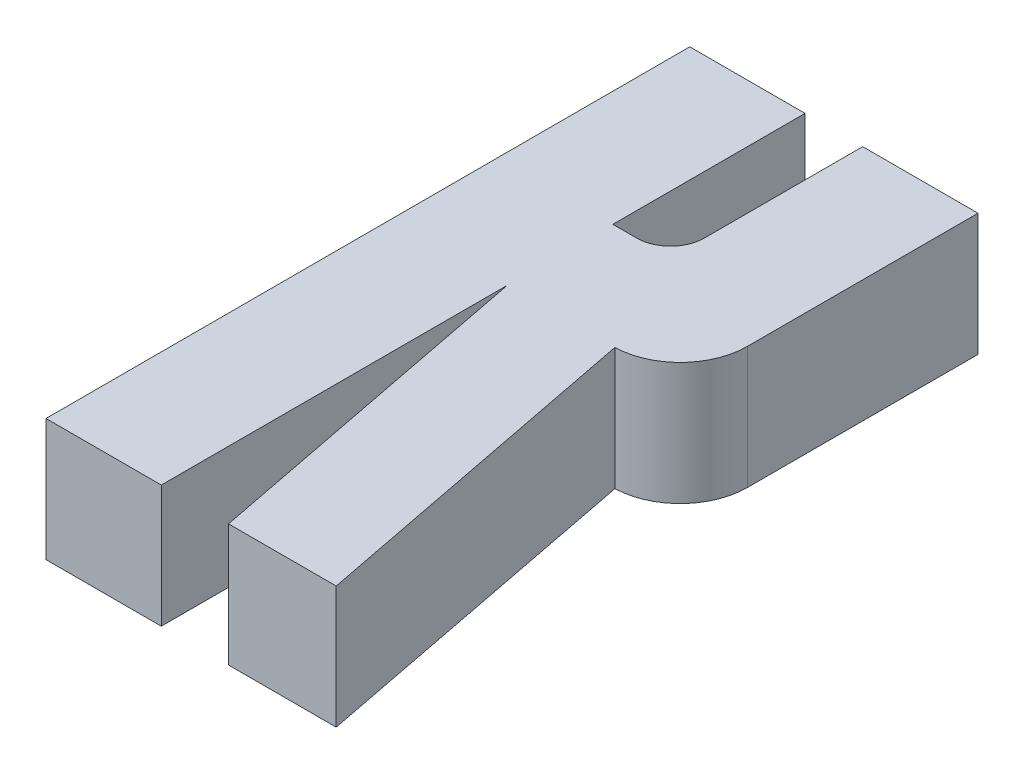
ISO-10303-21;
HEADER;
FILE_DESCRIPTION(('STEP AP214'),'2;1');
FILE_NAME('part.step','',(''),(''),'','','');
FILE_SCHEMA(('AUTOMOTIVE_DESIGN { 1 0 10303 214 1 1 1 1 }'));
ENDSEC;
DATA;
#1=APPLICATION_CONTEXT('core data for automotive mechanical design processes');
#2=APPLICATION_PROTOCOL_DEFINITION('international standard','automotive_design',2000,#1);
#3=PRODUCT_CONTEXT('',#1,'mechanical');
#4=PRODUCT('Part','Part','',(#3));
#5=PRODUCT_RELATED_PRODUCT_CATEGORY('part','',(#4));
#6=PRODUCT_DEFINITION_FORMATION('','',#4);
#7=PRODUCT_DEFINITION_CONTEXT('part definition',#1,'design');
#8=PRODUCT_DEFINITION('design','',#6,#7);
#9=PRODUCT_DEFINITION_SHAPE('','',#8);
#10=(LENGTH_UNIT() NAMED_UNIT(*) SI_UNIT(.MILLI.,.METRE.));
#11=(NAMED_UNIT(*) PLANE_ANGLE_UNIT() SI_UNIT($,.RADIAN.));
#12=(NAMED_UNIT(*) SI_UNIT($,.STERADIAN.) SOLID_ANGLE_UNIT());
#13=UNCERTAINTY_MEASURE_WITH_UNIT(LENGTH_MEASURE(1.E-05),#10,'distance_accuracy_value','');
#14=(GEOMETRIC_REPRESENTATION_CONTEXT(3) GLOBAL_UNCERTAINTY_ASSIGNED_CONTEXT((#13)) GLOBAL_UNIT_ASSIGNED_CONTEXT((#10,
#11,#12)) REPRESENTATION_CONTEXT('',''));
#15=CARTESIAN_POINT('',(0.,0.,0.));
#16=DIRECTION('',(0.,0.,1.));
#17=DIRECTION('',(1.,0.,0.));
#18=AXIS2_PLACEMENT_3D('',#15,#16,#17);
#19=CARTESIAN_POINT('',(857.737617422486,-71.,1297.8980276768));
#20=DIRECTION('',(1.,0.,0.));
#21=DIRECTION('',(0.,0.,-1.));
#22=AXIS2_PLACEMENT_3D('',#19,#20,#21);
#23=PLANE('',#22);
#24=DIRECTION('',(0.,0.,1.));
#25=VECTOR('',#24,1.);
#26=CARTESIAN_POINT('',(857.737617422486,-79.,1297.8980276768));
#27=LINE('',#26,#25);
#28=CARTESIAN_POINT('',(857.737617422486,-79.,1297.8980276768));
#29=VERTEX_POINT('',#28);
#30=CARTESIAN_POINT('',(857.737617422486,-79.,1340.0191783547));
#31=VERTEX_POINT('',#30);
#32=EDGE_CURVE('E123',#29,#31,#27,.T.);
#33=ORIENTED_EDGE('',*,*,#32,.T.);
#34=DIRECTION('',(0.,-1.,0.));
#35=VECTOR('',#34,1.);
#36=CARTESIAN_POINT('',(857.737617422486,-71.,1340.0191783547));
#37=LINE('',#36,#35);
#38=CARTESIAN_POINT('',(857.737617422486,-71.,1340.0191783547));
#39=VERTEX_POINT('',#38);
#40=EDGE_CURVE('E11',#39,#31,#37,.T.);
#41=ORIENTED_EDGE('',*,*,#40,.F.);
#42=DIRECTION('',(0.,0.,1.));
#43=VECTOR('',#42,1.);
#44=CARTESIAN_POINT('',(857.737617422486,-71.,1297.8980276768));
#45=LINE('',#44,#43);
#46=CARTESIAN_POINT('',(857.737617422486,-71.,1297.8980276768));
#47=VERTEX_POINT('',#46);
#48=EDGE_CURVE('E142',#47,#39,#45,.T.);
#49=ORIENTED_EDGE('',*,*,#48,.F.);
#50=DIRECTION('',(0.,-1.,0.));
#51=VECTOR('',#50,1.);
#52=CARTESIAN_POINT('',(857.737617422486,-71.,1297.8980276768));
#53=LINE('',#52,#51);
#54=EDGE_CURVE('E30',#47,#29,#53,.T.);
#55=ORIENTED_EDGE('',*,*,#54,.T.);
#56=EDGE_LOOP('',(#33,#41,#49,#55));
#57=FACE_BOUND('',#56,.T.);
#58=ADVANCED_FACE('F16',(#57),#23,.F.);
#59=CARTESIAN_POINT('',(857.737617422486,-71.,1340.0191783547));
#60=DIRECTION('',(0.,0.,-1.));
#61=DIRECTION('',(-1.,0.,0.));
#62=AXIS2_PLACEMENT_3D('',#59,#60,#61);
#63=PLANE('',#62);
#64=DIRECTION('',(1.,0.,0.));
#65=VECTOR('',#64,1.);
#66=CARTESIAN_POINT('',(857.737617422486,-79.,1340.0191783547));
#67=LINE('',#66,#65);
#68=CARTESIAN_POINT('',(865.281704111066,-79.,1340.0191783547));
#69=VERTEX_POINT('',#68);
#70=EDGE_CURVE('E119',#31,#69,#67,.T.);
#71=ORIENTED_EDGE('',*,*,#70,.T.);
#72=DIRECTION('',(0.,-1.,0.));
#73=VECTOR('',#72,1.);
#74=CARTESIAN_POINT('',(865.281704111066,-71.,1340.0191783547));
#75=LINE('',#74,#73);
#76=CARTESIAN_POINT('',(865.281704111066,-71.,1340.0191783547));
#77=VERTEX_POINT('',#76);
#78=EDGE_CURVE('E23',#77,#69,#75,.T.);
#79=ORIENTED_EDGE('',*,*,#78,.F.);
#80=DIRECTION('',(1.,0.,0.));
#81=VECTOR('',#80,1.);
#82=CARTESIAN_POINT('',(857.737617422486,-71.,1340.0191783547));
#83=LINE('',#82,#81);
#84=EDGE_CURVE('E132',#39,#77,#83,.T.);
#85=ORIENTED_EDGE('',*,*,#84,.F.);
#86=ORIENTED_EDGE('',*,*,#40,.T.);
#87=EDGE_LOOP('',(#71,#79,#85,#86));
#88=FACE_BOUND('',#87,.T.);
#89=ADVANCED_FACE('F131',(#88),#63,.F.);
#90=CARTESIAN_POINT('',(865.281704111066,-71.,1340.0191783547));
#91=DIRECTION('',(-1.,0.,0.));
#92=DIRECTION('',(0.,0.,1.));
#93=AXIS2_PLACEMENT_3D('',#90,#91,#92);
#94=PLANE('',#93);
#95=DIRECTION('',(0.,0.,-1.));
#96=VECTOR('',#95,1.);
#97=CARTESIAN_POINT('',(865.281704111066,-79.,1340.0191783547));
#98=LINE('',#97,#96);
#99=CARTESIAN_POINT('',(865.281704111066,-79.,1317.38691828896));
#100=VERTEX_POINT('',#99);
#101=EDGE_CURVE('E125',#69,#100,#98,.T.);
#102=ORIENTED_EDGE('',*,*,#101,.T.);
#103=DIRECTION('',(0.,-1.,0.));
#104=VECTOR('',#103,1.);
#105=CARTESIAN_POINT('',(865.281704111066,-71.,1317.38691828896));
#106=LINE('',#105,#104);
#107=CARTESIAN_POINT('',(865.281704111066,-71.,1317.38691828896));
#108=VERTEX_POINT('',#107);
#109=EDGE_CURVE('E193',#108,#100,#106,.T.);
#110=ORIENTED_EDGE('',*,*,#109,.F.);
#111=DIRECTION('',(0.,0.,-1.));
#112=VECTOR('',#111,1.);
#113=CARTESIAN_POINT('',(865.281704111066,-71.,1340.0191783547));
#114=LINE('',#113,#112);
#115=EDGE_CURVE('E141',#77,#108,#114,.T.);
#116=ORIENTED_EDGE('',*,*,#115,.F.);
#117=ORIENTED_EDGE('',*,*,#78,.T.);
#118=EDGE_LOOP('',(#102,#110,#116,#117));
#119=FACE_BOUND('',#118,.T.);
#120=ADVANCED_FACE('F197',(#119),#94,.F.);
#121=CARTESIAN_POINT('',(865.281704111066,-71.,1317.38691828896));
#122=DIRECTION('',(0.981627183447664,0.,-0.190808995376545));
#123=DIRECTION('',(-0.190808995376545,0.,-0.981627183447664));
#124=AXIS2_PLACEMENT_3D('',#121,#122,#123);
#125=PLANE('',#124);
#126=DIRECTION('',(0.190808995376545,0.,0.981627183447664));
#127=VECTOR('',#126,1.);
#128=CARTESIAN_POINT('',(865.281704111066,-79.,1317.38691828896));
#129=LINE('',#128,#127);
#130=CARTESIAN_POINT('',(869.680969819129,-79.,1340.0191783547));
#131=VERTEX_POINT('',#130);
#132=EDGE_CURVE('E234',#100,#131,#129,.T.);
#133=ORIENTED_EDGE('',*,*,#132,.T.);
#134=DIRECTION('',(0.,-1.,0.));
#135=VECTOR('',#134,1.);
#136=CARTESIAN_POINT('',(869.680969819129,-71.,1340.0191783547));
#137=LINE('',#136,#135);
#138=CARTESIAN_POINT('',(869.680969819129,-71.,1340.0191783547));
#139=VERTEX_POINT('',#138);
#140=EDGE_CURVE('E190',#139,#131,#137,.T.);
#141=ORIENTED_EDGE('',*,*,#140,.F.);
#142=DIRECTION('',(0.190808995376545,0.,0.981627183447664));
#143=VECTOR('',#142,1.);
#144=CARTESIAN_POINT('',(865.281704111066,-71.,1317.38691828896));
#145=LINE('',#144,#143);
#146=EDGE_CURVE('E144',#108,#139,#145,.T.);
#147=ORIENTED_EDGE('',*,*,#146,.F.);
#148=ORIENTED_EDGE('',*,*,#109,.T.);
#149=EDGE_LOOP('',(#133,#141,#147,#148));
#150=FACE_BOUND('',#149,.T.);
#151=ADVANCED_FACE('F237',(#150),#125,.F.);
#152=CARTESIAN_POINT('',(869.680969819129,-71.,1340.0191783547));
#153=DIRECTION('',(0.,0.,-1.));
#154=DIRECTION('',(-1.,0.,0.));
#155=AXIS2_PLACEMENT_3D('',#152,#153,#154);
#156=PLANE('',#155);
#157=DIRECTION('',(1.,0.,0.));
#158=VECTOR('',#157,1.);
#159=CARTESIAN_POINT('',(869.680969819129,-79.,1340.0191783547));
#160=LINE('',#159,#158);
#161=CARTESIAN_POINT('',(876.725816288821,-79.,1340.0191783547));
#162=VERTEX_POINT('',#161);
#163=EDGE_CURVE('E231',#131,#162,#160,.T.);
#164=ORIENTED_EDGE('',*,*,#163,.T.);
#165=DIRECTION('',(0.,-1.,0.));
#166=VECTOR('',#165,1.);
#167=CARTESIAN_POINT('',(876.725816288821,-71.,1340.0191783547));
#168=LINE('',#167,#166);
#169=CARTESIAN_POINT('',(876.725816288821,-71.,1340.0191783547));
#170=VERTEX_POINT('',#169);
#171=EDGE_CURVE('E188',#170,#162,#168,.T.);
#172=ORIENTED_EDGE('',*,*,#171,.F.);
#173=DIRECTION('',(1.,0.,0.));
#174=VECTOR('',#173,1.);
#175=CARTESIAN_POINT('',(869.680969819129,-71.,1340.0191783547));
#176=LINE('',#175,#174);
#177=EDGE_CURVE('E146',#139,#170,#176,.T.);
#178=ORIENTED_EDGE('',*,*,#177,.F.);
#179=ORIENTED_EDGE('',*,*,#140,.T.);
#180=EDGE_LOOP('',(#164,#172,#178,#179));
#181=FACE_BOUND('',#180,.T.);
#182=ADVANCED_FACE('F241',(#181),#156,.F.);
#183=CARTESIAN_POINT('',(872.326182609485,-71.,1317.38502524088));
#184=DIRECTION('',(0.981627183447664,0.,-0.190808995376545));
#185=DIRECTION('',(-0.190808995376545,0.,-0.981627183447664));
#186=AXIS2_PLACEMENT_3D('',#183,#184,#185);
#187=PLANE('',#186);
#188=DIRECTION('',(0.190808995376545,0.,0.981627183447664));
#189=VECTOR('',#188,1.);
#190=CARTESIAN_POINT('',(872.326182609485,-79.,1317.38502524088));
#191=LINE('',#190,#189);
#192=CARTESIAN_POINT('',(872.326182609485,-79.,1317.38502524088));
#193=VERTEX_POINT('',#192);
#194=EDGE_CURVE('E228',#193,#162,#191,.T.);
#195=ORIENTED_EDGE('',*,*,#194,.F.);
#196=DIRECTION('',(0.,-1.,0.));
#197=VECTOR('',#196,1.);
#198=CARTESIAN_POINT('',(872.326182609485,-71.,1317.38502524088));
#199=LINE('',#198,#197);
#200=CARTESIAN_POINT('',(872.326182609485,-71.,1317.38502524088));
#201=VERTEX_POINT('',#200);
#202=EDGE_CURVE('E186',#201,#193,#199,.T.);
#203=ORIENTED_EDGE('',*,*,#202,.F.);
#204=DIRECTION('',(0.190808995376545,0.,0.981627183447664));
#205=VECTOR('',#204,1.);
#206=CARTESIAN_POINT('',(872.326182609485,-71.,1317.38502524088));
#207=LINE('',#206,#205);
#208=EDGE_CURVE('E148',#201,#170,#207,.T.);
#209=ORIENTED_EDGE('',*,*,#208,.T.);
#210=ORIENTED_EDGE('',*,*,#171,.T.);
#211=EDGE_LOOP('',(#195,#203,#209,#210));
#212=FACE_BOUND('',#211,.T.);
#213=ADVANCED_FACE('F247',(#212),#187,.T.);
#214=CARTESIAN_POINT('',(872.19711690893,-71.,1312.98620105396));
#215=DIRECTION('',(0.,-1.,0.));
#216=DIRECTION('',(0.,0.,-1.));
#217=AXIS2_PLACEMENT_3D('',#214,#215,#216);
#218=CYLINDRICAL_SURFACE('',#217,4.40071723500474);
#219=CARTESIAN_POINT('',(872.19711690893,-79.,1312.98620105396));
#220=DIRECTION('',(0.,-1.,0.));
#221=DIRECTION('',(1.,0.,0.));
#222=AXIS2_PLACEMENT_3D('',#219,#220,#221);
#223=CIRCLE('',#222,4.40071723500474);
#224=CARTESIAN_POINT('',(876.597834143935,-79.,1312.98620105396));
#225=VERTEX_POINT('',#224);
#226=EDGE_CURVE('E225',#225,#193,#223,.T.);
#227=ORIENTED_EDGE('',*,*,#226,.F.);
#228=DIRECTION('',(0.,-1.,0.));
#229=VECTOR('',#228,1.);
#230=CARTESIAN_POINT('',(876.597834143935,-71.,1312.98620105396));
#231=LINE('',#230,#229);
#232=CARTESIAN_POINT('',(876.597834143935,-71.,1312.98620105396));
#233=VERTEX_POINT('',#232);
#234=EDGE_CURVE('E184',#233,#225,#231,.T.);
#235=ORIENTED_EDGE('',*,*,#234,.F.);
#236=CARTESIAN_POINT('',(872.19711690893,-71.,1312.98620105396));
#237=DIRECTION('',(0.,-1.,0.));
#238=DIRECTION('',(1.,0.,0.));
#239=AXIS2_PLACEMENT_3D('',#236,#237,#238);
#240=CIRCLE('',#239,4.40071723500474);
#241=EDGE_CURVE('E151',#233,#201,#240,.T.);
#242=ORIENTED_EDGE('',*,*,#241,.T.);
#243=ORIENTED_EDGE('',*,*,#202,.T.);
#244=EDGE_LOOP('',(#227,#235,#242,#243));
#245=FACE_BOUND('',#244,.T.);
#246=ADVANCED_FACE('F251',(#245),#218,.T.);
#247=CARTESIAN_POINT('',(876.597834143935,-71.,1312.98620105396));
#248=DIRECTION('',(-1.,0.,0.));
#249=DIRECTION('',(0.,0.,1.));
#250=AXIS2_PLACEMENT_3D('',#247,#248,#249);
#251=PLANE('',#250);
#252=DIRECTION('',(0.,0.,-1.));
#253=VECTOR('',#252,1.);
#254=CARTESIAN_POINT('',(876.597834143935,-79.,1312.98620105396));
#255=LINE('',#254,#253);
#256=CARTESIAN_POINT('',(876.597834143935,-79.,1297.8980276768));
#257=VERTEX_POINT('',#256);
#258=EDGE_CURVE('E222',#225,#257,#255,.T.);
#259=ORIENTED_EDGE('',*,*,#258,.T.);
#260=DIRECTION('',(0.,-1.,0.));
#261=VECTOR('',#260,1.);
#262=CARTESIAN_POINT('',(876.597834143935,-71.,1297.8980276768));
#263=LINE('',#262,#261);
#264=CARTESIAN_POINT('',(876.597834143935,-71.,1297.8980276768));
#265=VERTEX_POINT('',#264);
#266=EDGE_CURVE('E182',#265,#257,#263,.T.);
#267=ORIENTED_EDGE('',*,*,#266,.F.);
#268=DIRECTION('',(0.,0.,-1.));
#269=VECTOR('',#268,1.);
#270=CARTESIAN_POINT('',(876.597834143935,-71.,1312.98620105396));
#271=LINE('',#270,#269);
#272=EDGE_CURVE('E154',#233,#265,#271,.T.);
#273=ORIENTED_EDGE('',*,*,#272,.F.);
#274=ORIENTED_EDGE('',*,*,#234,.T.);
#275=EDGE_LOOP('',(#259,#267,#273,#274));
#276=FACE_BOUND('',#275,.T.);
#277=ADVANCED_FACE('F255',(#276),#251,.F.);
#278=CARTESIAN_POINT('',(869.053747455356,-71.,1297.8980276768));
#279=DIRECTION('',(0.,0.,-1.));
#280=DIRECTION('',(-1.,0.,0.));
#281=AXIS2_PLACEMENT_3D('',#278,#279,#280);
#282=PLANE('',#281);
#283=DIRECTION('',(1.,0.,0.));
#284=VECTOR('',#283,1.);
#285=CARTESIAN_POINT('',(869.053747455356,-79.,1297.8980276768));
#286=LINE('',#285,#284);
#287=CARTESIAN_POINT('',(869.053747455356,-79.,1297.8980276768));
#288=VERTEX_POINT('',#287);
#289=EDGE_CURVE('E219',#288,#257,#286,.T.);
#290=ORIENTED_EDGE('',*,*,#289,.F.);
#291=DIRECTION('',(0.,-1.,0.));
#292=VECTOR('',#291,1.);
#293=CARTESIAN_POINT('',(869.053747455356,-71.,1297.8980276768));
#294=LINE('',#293,#292);
#295=CARTESIAN_POINT('',(869.053747455356,-71.,1297.8980276768));
#296=VERTEX_POINT('',#295);
#297=EDGE_CURVE('E180',#296,#288,#294,.T.);
#298=ORIENTED_EDGE('',*,*,#297,.F.);
#299=DIRECTION('',(1.,0.,0.));
#300=VECTOR('',#299,1.);
#301=CARTESIAN_POINT('',(869.053747455356,-71.,1297.8980276768));
#302=LINE('',#301,#300);
#303=EDGE_CURVE('E156',#296,#265,#302,.T.);
#304=ORIENTED_EDGE('',*,*,#303,.T.);
#305=ORIENTED_EDGE('',*,*,#266,.T.);
#306=EDGE_LOOP('',(#290,#298,#304,#305));
#307=FACE_BOUND('',#306,.T.);
#308=ADVANCED_FACE('F270',(#307),#282,.T.);
#309=CARTESIAN_POINT('',(869.053747455356,-71.,1308.2711468736));
#310=DIRECTION('',(-1.,0.,0.));
#311=DIRECTION('',(0.,0.,1.));
#312=AXIS2_PLACEMENT_3D('',#309,#310,#311);
#313=PLANE('',#312);
#314=DIRECTION('',(0.,0.,-1.));
#315=VECTOR('',#314,1.);
#316=CARTESIAN_POINT('',(869.053747455356,-79.,1308.2711468736));
#317=LINE('',#316,#315);
#318=CARTESIAN_POINT('',(869.053747455356,-79.,1308.2711468736));
#319=VERTEX_POINT('',#318);
#320=EDGE_CURVE('E216',#319,#288,#317,.T.);
#321=ORIENTED_EDGE('',*,*,#320,.F.);
#322=DIRECTION('',(0.,-1.,0.));
#323=VECTOR('',#322,1.);
#324=CARTESIAN_POINT('',(869.053747455356,-71.,1308.2711468736));
#325=LINE('',#324,#323);
#326=CARTESIAN_POINT('',(869.053747455356,-71.,1308.2711468736));
#327=VERTEX_POINT('',#326);
#328=EDGE_CURVE('E178',#327,#319,#325,.T.);
#329=ORIENTED_EDGE('',*,*,#328,.F.);
#330=DIRECTION('',(0.,0.,-1.));
#331=VECTOR('',#330,1.);
#332=CARTESIAN_POINT('',(869.053747455356,-71.,1308.2711468736));
#333=LINE('',#332,#331);
#334=EDGE_CURVE('E159',#327,#296,#333,.T.);
#335=ORIENTED_EDGE('',*,*,#334,.T.);
#336=ORIENTED_EDGE('',*,*,#297,.T.);
#337=EDGE_LOOP('',(#321,#329,#335,#336));
#338=FACE_BOUND('',#337,.T.);
#339=ADVANCED_FACE('F261',(#338),#313,.T.);
#340=CARTESIAN_POINT('',(866.853388837853,-71.,1308.2711468736));
#341=DIRECTION('',(0.,-1.,0.));
#342=DIRECTION('',(0.,0.,-1.));
#343=AXIS2_PLACEMENT_3D('',#340,#341,#342);
#344=CYLINDRICAL_SURFACE('',#343,2.20035861750237);
#345=CARTESIAN_POINT('',(866.853388837853,-79.,1308.2711468736));
#346=DIRECTION('',(0.,-1.,0.));
#347=DIRECTION('',(1.,0.,0.));
#348=AXIS2_PLACEMENT_3D('',#345,#346,#347);
#349=CIRCLE('',#348,2.20035861750237);
#350=CARTESIAN_POINT('',(866.853388837853,-79.,1310.4715054911));
#351=VERTEX_POINT('',#350);
#352=EDGE_CURVE('E211',#319,#351,#349,.T.);
#353=ORIENTED_EDGE('',*,*,#352,.T.);
#354=DIRECTION('',(0.,-1.,0.));
#355=VECTOR('',#354,1.);
#356=CARTESIAN_POINT('',(866.853388837853,-71.,1310.4715054911));
#357=LINE('',#356,#355);
#358=CARTESIAN_POINT('',(866.853388837853,-71.,1310.4715054911));
#359=VERTEX_POINT('',#358);
#360=EDGE_CURVE('E176',#359,#351,#357,.T.);
#361=ORIENTED_EDGE('',*,*,#360,.F.);
#362=CARTESIAN_POINT('',(866.853388837853,-71.,1308.2711468736));
#363=DIRECTION('',(0.,-1.,0.));
#364=DIRECTION('',(1.,0.,0.));
#365=AXIS2_PLACEMENT_3D('',#362,#363,#364);
#366=CIRCLE('',#365,2.20035861750237);
#367=EDGE_CURVE('E162',#327,#359,#366,.T.);
#368=ORIENTED_EDGE('',*,*,#367,.F.);
#369=ORIENTED_EDGE('',*,*,#328,.T.);
#370=EDGE_LOOP('',(#353,#361,#368,#369));
#371=FACE_BOUND('',#370,.T.);
#372=ADVANCED_FACE('F267',(#371),#344,.F.);
#373=CARTESIAN_POINT('',(865.281704111066,-71.,1310.4715054911));
#374=DIRECTION('',(0.,0.,-1.));
#375=DIRECTION('',(-1.,0.,0.));
#376=AXIS2_PLACEMENT_3D('',#373,#374,#375);
#377=PLANE('',#376);
#378=DIRECTION('',(1.,0.,0.));
#379=VECTOR('',#378,1.);
#380=CARTESIAN_POINT('',(865.281704111066,-79.,1310.4715054911));
#381=LINE('',#380,#379);
#382=CARTESIAN_POINT('',(865.281704111066,-79.,1310.4715054911));
#383=VERTEX_POINT('',#382);
#384=EDGE_CURVE('E210',#383,#351,#381,.T.);
#385=ORIENTED_EDGE('',*,*,#384,.F.);
#386=DIRECTION('',(0.,-1.,0.));
#387=VECTOR('',#386,1.);
#388=CARTESIAN_POINT('',(865.281704111066,-71.,1310.4715054911));
#389=LINE('',#388,#387);
#390=CARTESIAN_POINT('',(865.281704111066,-71.,1310.4715054911));
#391=VERTEX_POINT('',#390);
#392=EDGE_CURVE('E174',#391,#383,#389,.T.);
#393=ORIENTED_EDGE('',*,*,#392,.F.);
#394=DIRECTION('',(1.,0.,0.));
#395=VECTOR('',#394,1.);
#396=CARTESIAN_POINT('',(865.281704111066,-71.,1310.4715054911));
#397=LINE('',#396,#395);
#398=EDGE_CURVE('E164',#391,#359,#397,.T.);
#399=ORIENTED_EDGE('',*,*,#398,.T.);
#400=ORIENTED_EDGE('',*,*,#360,.T.);
#401=EDGE_LOOP('',(#385,#393,#399,#400));
#402=FACE_BOUND('',#401,.T.);
#403=ADVANCED_FACE('F269',(#402),#377,.T.);
#404=CARTESIAN_POINT('',(865.281704111066,-71.,1310.4715054911));
#405=DIRECTION('',(-1.,0.,0.));
#406=DIRECTION('',(0.,0.,1.));
#407=AXIS2_PLACEMENT_3D('',#404,#405,#406);
#408=PLANE('',#407);
#409=DIRECTION('',(0.,0.,-1.));
#410=VECTOR('',#409,1.);
#411=CARTESIAN_POINT('',(865.281704111066,-79.,1310.4715054911));
#412=LINE('',#411,#410);
#413=CARTESIAN_POINT('',(865.281704111066,-79.,1297.8980276768));
#414=VERTEX_POINT('',#413);
#415=EDGE_CURVE('E206',#383,#414,#412,.T.);
#416=ORIENTED_EDGE('',*,*,#415,.T.);
#417=DIRECTION('',(0.,-1.,0.));
#418=VECTOR('',#417,1.);
#419=CARTESIAN_POINT('',(865.281704111066,-71.,1297.8980276768));
#420=LINE('',#419,#418);
#421=CARTESIAN_POINT('',(865.281704111066,-71.,1297.8980276768));
#422=VERTEX_POINT('',#421);
#423=EDGE_CURVE('E172',#422,#414,#420,.T.);
#424=ORIENTED_EDGE('',*,*,#423,.F.);
#425=DIRECTION('',(0.,0.,-1.));
#426=VECTOR('',#425,1.);
#427=CARTESIAN_POINT('',(865.281704111066,-71.,1310.4715054911));
#428=LINE('',#427,#426);
#429=EDGE_CURVE('E38',#391,#422,#428,.T.);
#430=ORIENTED_EDGE('',*,*,#429,.F.);
#431=ORIENTED_EDGE('',*,*,#392,.T.);
#432=EDGE_LOOP('',(#416,#424,#430,#431));
#433=FACE_BOUND('',#432,.T.);
#434=ADVANCED_FACE('F207',(#433),#408,.F.);
#435=CARTESIAN_POINT('',(857.737617422486,-71.,1297.8980276768));
#436=DIRECTION('',(0.,0.,-1.));
#437=DIRECTION('',(-1.,0.,0.));
#438=AXIS2_PLACEMENT_3D('',#435,#436,#437);
#439=PLANE('',#438);
#440=DIRECTION('',(1.,0.,0.));
#441=VECTOR('',#440,1.);
#442=CARTESIAN_POINT('',(857.737617422486,-79.,1297.8980276768));
#443=LINE('',#442,#441);
#444=EDGE_CURVE('E138',#29,#414,#443,.T.);
#445=ORIENTED_EDGE('',*,*,#444,.F.);
#446=ORIENTED_EDGE('',*,*,#54,.F.);
#447=DIRECTION('',(1.,0.,0.));
#448=VECTOR('',#447,1.);
#449=CARTESIAN_POINT('',(857.737617422486,-71.,1297.8980276768));
#450=LINE('',#449,#448);
#451=EDGE_CURVE('E168',#47,#422,#450,.T.);
#452=ORIENTED_EDGE('',*,*,#451,.T.);
#453=ORIENTED_EDGE('',*,*,#423,.T.);
#454=EDGE_LOOP('',(#445,#446,#452,#453));
#455=FACE_BOUND('',#454,.T.);
#456=ADVANCED_FACE('F202',(#455),#439,.T.);
#457=CARTESIAN_POINT('',(872.19711690893,-71.,1312.98620105396));
#458=DIRECTION('',(0.,-1.,0.));
#459=DIRECTION('',(0.,0.,-1.));
#460=AXIS2_PLACEMENT_3D('',#457,#458,#459);
#461=PLANE('',#460);
#462=ORIENTED_EDGE('',*,*,#48,.T.);
#463=ORIENTED_EDGE('',*,*,#84,.T.);
#464=ORIENTED_EDGE('',*,*,#115,.T.);
#465=ORIENTED_EDGE('',*,*,#146,.T.);
#466=ORIENTED_EDGE('',*,*,#177,.T.);
#467=ORIENTED_EDGE('',*,*,#208,.F.);
#468=ORIENTED_EDGE('',*,*,#241,.F.);
#469=ORIENTED_EDGE('',*,*,#272,.T.);
#470=ORIENTED_EDGE('',*,*,#303,.F.);
#471=ORIENTED_EDGE('',*,*,#334,.F.);
#472=ORIENTED_EDGE('',*,*,#367,.T.);
#473=ORIENTED_EDGE('',*,*,#398,.F.);
#474=ORIENTED_EDGE('',*,*,#429,.T.);
#475=ORIENTED_EDGE('',*,*,#451,.F.);
#476=EDGE_LOOP('',(#462,#463,#464,#465,#466,#467,#468,#469,#470,#471,#472,#473,#474,#475));
#477=FACE_BOUND('',#476,.T.);
#478=ADVANCED_FACE('F200',(#477),#461,.F.);
#479=CARTESIAN_POINT('',(872.19711690893,-79.,1312.98620105396));
#480=DIRECTION('',(0.,-1.,0.));
#481=DIRECTION('',(0.,0.,-1.));
#482=AXIS2_PLACEMENT_3D('',#479,#480,#481);
#483=PLANE('',#482);
#484=ORIENTED_EDGE('',*,*,#32,.F.);
#485=ORIENTED_EDGE('',*,*,#444,.T.);
#486=ORIENTED_EDGE('',*,*,#415,.F.);
#487=ORIENTED_EDGE('',*,*,#384,.T.);
#488=ORIENTED_EDGE('',*,*,#352,.F.);
#489=ORIENTED_EDGE('',*,*,#320,.T.);
#490=ORIENTED_EDGE('',*,*,#289,.T.);
#491=ORIENTED_EDGE('',*,*,#258,.F.);
#492=ORIENTED_EDGE('',*,*,#226,.T.);
#493=ORIENTED_EDGE('',*,*,#194,.T.);
#494=ORIENTED_EDGE('',*,*,#163,.F.);
#495=ORIENTED_EDGE('',*,*,#132,.F.);
#496=ORIENTED_EDGE('',*,*,#101,.F.);
#497=ORIENTED_EDGE('',*,*,#70,.F.);
#498=EDGE_LOOP('',(#484,#485,#486,#487,#488,#489,#490,#491,#492,#493,#494,#495,#496,#497));
#499=FACE_BOUND('',#498,.T.);
#500=ADVANCED_FACE('F120',(#499),#483,.T.);
#501=CLOSED_SHELL('',(#58,#89,#120,#151,#182,#213,#246,#277,#308,#339,#372,#403,#434,#456,#478,#500));
#502=MANIFOLD_SOLID_BREP('B1',#501);
#503=ADVANCED_BREP_SHAPE_REPRESENTATION('',(#18,#502),#14);
#504=SHAPE_DEFINITION_REPRESENTATION(#9,#503);
ENDSEC;
END-ISO-10303-21;
